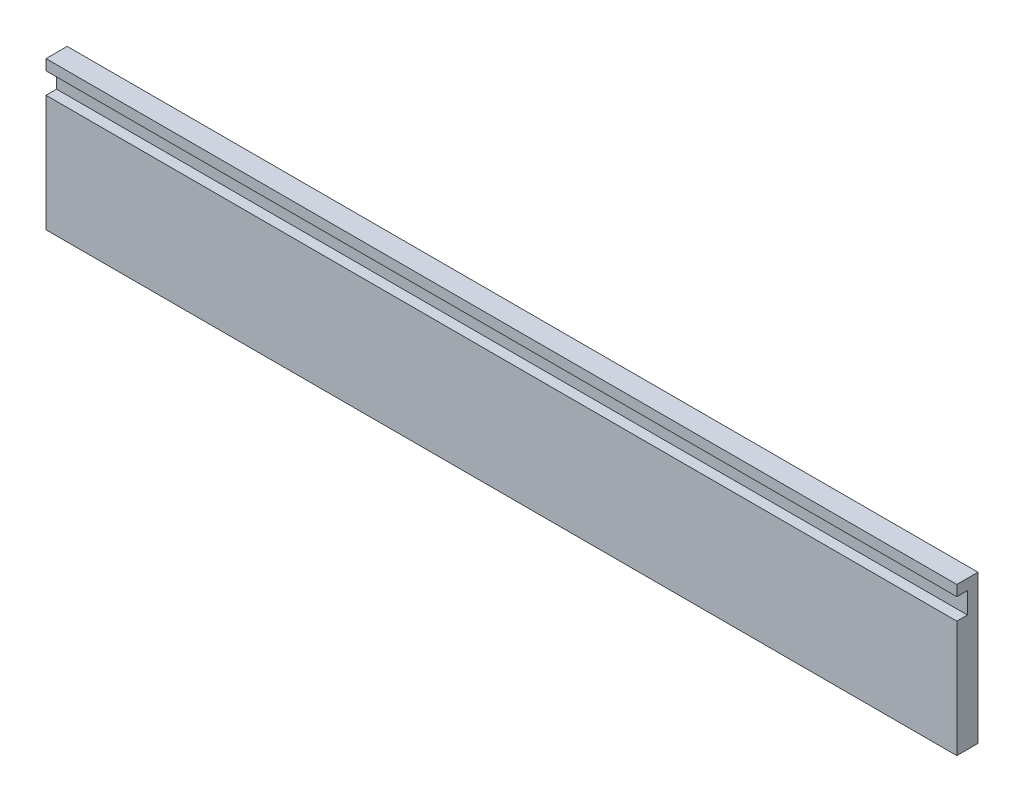
ISO-10303-21;
HEADER;
FILE_DESCRIPTION(('STEP AP214'),'2;1');
FILE_NAME('part.step','',(''),(''),'','','');
FILE_SCHEMA(('AUTOMOTIVE_DESIGN { 1 0 10303 214 1 1 1 1 }'));
ENDSEC;
DATA;
#1=APPLICATION_CONTEXT('core data for automotive mechanical design processes');
#2=APPLICATION_PROTOCOL_DEFINITION('international standard','automotive_design',2000,#1);
#3=PRODUCT_CONTEXT('',#1,'mechanical');
#4=PRODUCT('Part','Part','',(#3));
#5=PRODUCT_RELATED_PRODUCT_CATEGORY('part','',(#4));
#6=PRODUCT_DEFINITION_FORMATION('','',#4);
#7=PRODUCT_DEFINITION_CONTEXT('part definition',#1,'design');
#8=PRODUCT_DEFINITION('design','',#6,#7);
#9=PRODUCT_DEFINITION_SHAPE('','',#8);
#10=(LENGTH_UNIT() NAMED_UNIT(*) SI_UNIT(.MILLI.,.METRE.));
#11=(NAMED_UNIT(*) PLANE_ANGLE_UNIT() SI_UNIT($,.RADIAN.));
#12=(NAMED_UNIT(*) SI_UNIT($,.STERADIAN.) SOLID_ANGLE_UNIT());
#13=UNCERTAINTY_MEASURE_WITH_UNIT(LENGTH_MEASURE(1.E-05),#10,'distance_accuracy_value','');
#14=(GEOMETRIC_REPRESENTATION_CONTEXT(3) GLOBAL_UNCERTAINTY_ASSIGNED_CONTEXT((#13)) GLOBAL_UNIT_ASSIGNED_CONTEXT((#10,
#11,#12)) REPRESENTATION_CONTEXT('',''));
#15=CARTESIAN_POINT('',(0.,0.,0.));
#16=DIRECTION('',(0.,0.,1.));
#17=DIRECTION('',(1.,0.,0.));
#18=AXIS2_PLACEMENT_3D('',#15,#16,#17);
#19=CARTESIAN_POINT('',(0.,0.,12.7));
#20=DIRECTION('',(0.,0.,1.));
#21=DIRECTION('',(1.,0.,0.));
#22=AXIS2_PLACEMENT_3D('',#19,#20,#21);
#23=PLANE('',#22);
#24=DIRECTION('',(-1.,0.,0.));
#25=VECTOR('',#24,1.);
#26=CARTESIAN_POINT('',(-214.437575757576,87.9378787878788,12.7));
#27=LINE('',#26,#25);
#28=CARTESIAN_POINT('',(331.662424242424,87.9378787878788,12.7));
#29=VERTEX_POINT('',#28);
#30=CARTESIAN_POINT('',(-214.437575757576,87.9378787878788,12.7));
#31=VERTEX_POINT('',#30);
#32=EDGE_CURVE('E131',#29,#31,#27,.T.);
#33=ORIENTED_EDGE('',*,*,#32,.F.);
#34=DIRECTION('',(0.,1.,0.));
#35=VECTOR('',#34,1.);
#36=CARTESIAN_POINT('',(331.662424242424,94.2878787878788,12.7));
#37=LINE('',#36,#35);
#38=CARTESIAN_POINT('',(331.662424242424,94.2878787878788,12.7));
#39=VERTEX_POINT('',#38);
#40=EDGE_CURVE('E149',#29,#39,#37,.T.);
#41=ORIENTED_EDGE('',*,*,#40,.T.);
#42=DIRECTION('',(-1.,0.,0.));
#43=VECTOR('',#42,1.);
#44=CARTESIAN_POINT('',(-214.437575757576,94.2878787878788,12.7));
#45=LINE('',#44,#43);
#46=CARTESIAN_POINT('',(-214.437575757576,94.2878787878788,12.7));
#47=VERTEX_POINT('',#46);
#48=EDGE_CURVE('E63',#39,#47,#45,.T.);
#49=ORIENTED_EDGE('',*,*,#48,.T.);
#50=DIRECTION('',(0.,-1.,0.));
#51=VECTOR('',#50,1.);
#52=CARTESIAN_POINT('',(-214.437575757576,94.2878787878788,12.7));
#53=LINE('',#52,#51);
#54=EDGE_CURVE('E143',#47,#31,#53,.T.);
#55=ORIENTED_EDGE('',*,*,#54,.T.);
#56=EDGE_LOOP('',(#33,#41,#49,#55));
#57=FACE_BOUND('',#56,.T.);
#58=ADVANCED_FACE('F38',(#57),#23,.T.);
#59=CARTESIAN_POINT('',(-214.437575757576,94.2878787878788,12.7));
#60=DIRECTION('',(1.,0.,0.));
#61=DIRECTION('',(0.,0.,-1.));
#62=AXIS2_PLACEMENT_3D('',#59,#60,#61);
#63=PLANE('',#62);
#64=DIRECTION('',(0.,-1.,0.));
#65=VECTOR('',#64,1.);
#66=CARTESIAN_POINT('',(-214.437575757576,87.9378787878788,6.35));
#67=LINE('',#66,#65);
#68=CARTESIAN_POINT('',(-214.437575757576,87.9378787878788,6.35));
#69=VERTEX_POINT('',#68);
#70=CARTESIAN_POINT('',(-214.437575757576,75.2378787878788,6.35));
#71=VERTEX_POINT('',#70);
#72=EDGE_CURVE('E121',#69,#71,#67,.T.);
#73=ORIENTED_EDGE('',*,*,#72,.F.);
#74=DIRECTION('',(0.,0.,1.));
#75=VECTOR('',#74,1.);
#76=CARTESIAN_POINT('',(-214.437575757576,87.9378787878788,6.35));
#77=LINE('',#76,#75);
#78=EDGE_CURVE('E162',#69,#31,#77,.T.);
#79=ORIENTED_EDGE('',*,*,#78,.T.);
#80=ORIENTED_EDGE('',*,*,#54,.F.);
#81=DIRECTION('',(0.,0.,-1.));
#82=VECTOR('',#81,1.);
#83=CARTESIAN_POINT('',(-214.437575757576,94.2878787878788,12.7));
#84=LINE('',#83,#82);
#85=CARTESIAN_POINT('',(-214.437575757576,94.2878787878788,0.));
#86=VERTEX_POINT('',#85);
#87=EDGE_CURVE('E156',#47,#86,#84,.T.);
#88=ORIENTED_EDGE('',*,*,#87,.T.);
#89=DIRECTION('',(0.,-1.,0.));
#90=VECTOR('',#89,1.);
#91=CARTESIAN_POINT('',(-214.437575757576,94.2878787878788,0.));
#92=LINE('',#91,#90);
#93=CARTESIAN_POINT('',(-214.437575757576,5.38787878787881,0.));
#94=VERTEX_POINT('',#93);
#95=EDGE_CURVE('E157',#86,#94,#92,.T.);
#96=ORIENTED_EDGE('',*,*,#95,.T.);
#97=DIRECTION('',(0.,0.,-1.));
#98=VECTOR('',#97,1.);
#99=CARTESIAN_POINT('',(-214.437575757576,5.38787878787881,12.7));
#100=LINE('',#99,#98);
#101=CARTESIAN_POINT('',(-214.437575757576,5.38787878787881,12.7));
#102=VERTEX_POINT('',#101);
#103=EDGE_CURVE('E11',#102,#94,#100,.T.);
#104=ORIENTED_EDGE('',*,*,#103,.F.);
#105=CARTESIAN_POINT('',(-214.437575757576,75.2378787878788,12.7));
#106=VERTEX_POINT('',#105);
#107=EDGE_CURVE('E91',#106,#102,#53,.T.);
#108=ORIENTED_EDGE('',*,*,#107,.F.);
#109=DIRECTION('',(0.,0.,1.));
#110=VECTOR('',#109,1.);
#111=CARTESIAN_POINT('',(-214.437575757576,75.2378787878788,6.35));
#112=LINE('',#111,#110);
#113=EDGE_CURVE('E54',#71,#106,#112,.T.);
#114=ORIENTED_EDGE('',*,*,#113,.F.);
#115=EDGE_LOOP('',(#73,#79,#80,#88,#96,#104,#108,#114));
#116=FACE_BOUND('',#115,.T.);
#117=ADVANCED_FACE('F40',(#116),#63,.F.);
#118=CARTESIAN_POINT('',(-214.437575757576,5.38787878787881,12.7));
#119=DIRECTION('',(0.,1.,0.));
#120=DIRECTION('',(0.,0.,1.));
#121=AXIS2_PLACEMENT_3D('',#118,#119,#120);
#122=PLANE('',#121);
#123=DIRECTION('',(1.,0.,0.));
#124=VECTOR('',#123,1.);
#125=CARTESIAN_POINT('',(-214.437575757576,5.38787878787881,0.));
#126=LINE('',#125,#124);
#127=CARTESIAN_POINT('',(331.662424242424,5.38787878787881,0.));
#128=VERTEX_POINT('',#127);
#129=EDGE_CURVE('E161',#94,#128,#126,.T.);
#130=ORIENTED_EDGE('',*,*,#129,.T.);
#131=DIRECTION('',(0.,0.,-1.));
#132=VECTOR('',#131,1.);
#133=CARTESIAN_POINT('',(331.662424242424,5.38787878787881,12.7));
#134=LINE('',#133,#132);
#135=CARTESIAN_POINT('',(331.662424242424,5.38787878787881,12.7));
#136=VERTEX_POINT('',#135);
#137=EDGE_CURVE('E47',#136,#128,#134,.T.);
#138=ORIENTED_EDGE('',*,*,#137,.F.);
#139=DIRECTION('',(1.,0.,0.));
#140=VECTOR('',#139,1.);
#141=CARTESIAN_POINT('',(-214.437575757576,5.38787878787881,12.7));
#142=LINE('',#141,#140);
#143=EDGE_CURVE('E146',#102,#136,#142,.T.);
#144=ORIENTED_EDGE('',*,*,#143,.F.);
#145=ORIENTED_EDGE('',*,*,#103,.T.);
#146=EDGE_LOOP('',(#130,#138,#144,#145));
#147=FACE_BOUND('',#146,.T.);
#148=ADVANCED_FACE('F212',(#147),#122,.F.);
#149=CARTESIAN_POINT('',(331.662424242424,94.2878787878788,12.7));
#150=DIRECTION('',(-1.,0.,0.));
#151=DIRECTION('',(0.,0.,1.));
#152=AXIS2_PLACEMENT_3D('',#149,#150,#151);
#153=PLANE('',#152);
#154=ORIENTED_EDGE('',*,*,#40,.F.);
#155=DIRECTION('',(0.,0.,1.));
#156=VECTOR('',#155,1.);
#157=CARTESIAN_POINT('',(331.662424242424,87.9378787878788,6.35));
#158=LINE('',#157,#156);
#159=CARTESIAN_POINT('',(331.662424242424,87.9378787878788,6.35));
#160=VERTEX_POINT('',#159);
#161=EDGE_CURVE('E138',#160,#29,#158,.T.);
#162=ORIENTED_EDGE('',*,*,#161,.F.);
#163=DIRECTION('',(0.,1.,0.));
#164=VECTOR('',#163,1.);
#165=CARTESIAN_POINT('',(331.662424242424,87.9378787878788,6.35));
#166=LINE('',#165,#164);
#167=CARTESIAN_POINT('',(331.662424242424,75.2378787878788,6.35));
#168=VERTEX_POINT('',#167);
#169=EDGE_CURVE('E120',#168,#160,#166,.T.);
#170=ORIENTED_EDGE('',*,*,#169,.F.);
#171=DIRECTION('',(0.,0.,1.));
#172=VECTOR('',#171,1.);
#173=CARTESIAN_POINT('',(331.662424242424,75.2378787878788,6.35));
#174=LINE('',#173,#172);
#175=CARTESIAN_POINT('',(331.662424242424,75.2378787878788,12.7));
#176=VERTEX_POINT('',#175);
#177=EDGE_CURVE('E116',#168,#176,#174,.T.);
#178=ORIENTED_EDGE('',*,*,#177,.T.);
#179=EDGE_CURVE('E150',#136,#176,#37,.T.);
#180=ORIENTED_EDGE('',*,*,#179,.F.);
#181=ORIENTED_EDGE('',*,*,#137,.T.);
#182=DIRECTION('',(0.,1.,0.));
#183=VECTOR('',#182,1.);
#184=CARTESIAN_POINT('',(331.662424242424,94.2878787878788,0.));
#185=LINE('',#184,#183);
#186=CARTESIAN_POINT('',(331.662424242424,94.2878787878788,0.));
#187=VERTEX_POINT('',#186);
#188=EDGE_CURVE('E165',#128,#187,#185,.T.);
#189=ORIENTED_EDGE('',*,*,#188,.T.);
#190=DIRECTION('',(0.,0.,-1.));
#191=VECTOR('',#190,1.);
#192=CARTESIAN_POINT('',(331.662424242424,94.2878787878788,12.7));
#193=LINE('',#192,#191);
#194=EDGE_CURVE('E172',#39,#187,#193,.T.);
#195=ORIENTED_EDGE('',*,*,#194,.F.);
#196=EDGE_LOOP('',(#154,#162,#170,#178,#180,#181,#189,#195));
#197=FACE_BOUND('',#196,.T.);
#198=ADVANCED_FACE('F181',(#197),#153,.F.);
#199=CARTESIAN_POINT('',(-214.437575757576,94.2878787878788,12.7));
#200=DIRECTION('',(0.,-1.,0.));
#201=DIRECTION('',(0.,0.,-1.));
#202=AXIS2_PLACEMENT_3D('',#199,#200,#201);
#203=PLANE('',#202);
#204=DIRECTION('',(-1.,0.,0.));
#205=VECTOR('',#204,1.);
#206=CARTESIAN_POINT('',(-214.437575757576,94.2878787878788,0.));
#207=LINE('',#206,#205);
#208=EDGE_CURVE('E84',#187,#86,#207,.T.);
#209=ORIENTED_EDGE('',*,*,#208,.T.);
#210=ORIENTED_EDGE('',*,*,#87,.F.);
#211=ORIENTED_EDGE('',*,*,#48,.F.);
#212=ORIENTED_EDGE('',*,*,#194,.T.);
#213=EDGE_LOOP('',(#209,#210,#211,#212));
#214=FACE_BOUND('',#213,.T.);
#215=ADVANCED_FACE('F188',(#214),#203,.F.);
#216=DIRECTION('',(1.,0.,0.));
#217=VECTOR('',#216,1.);
#218=CARTESIAN_POINT('',(-214.437575757576,75.2378787878788,12.7));
#219=LINE('',#218,#217);
#220=EDGE_CURVE('E200',#106,#176,#219,.T.);
#221=ORIENTED_EDGE('',*,*,#220,.F.);
#222=ORIENTED_EDGE('',*,*,#107,.T.);
#223=ORIENTED_EDGE('',*,*,#143,.T.);
#224=ORIENTED_EDGE('',*,*,#179,.T.);
#225=EDGE_LOOP('',(#221,#222,#223,#224));
#226=FACE_BOUND('',#225,.T.);
#227=ADVANCED_FACE('F207',(#226),#23,.T.);
#228=CARTESIAN_POINT('',(0.,0.,0.));
#229=DIRECTION('',(0.,0.,1.));
#230=DIRECTION('',(1.,0.,0.));
#231=AXIS2_PLACEMENT_3D('',#228,#229,#230);
#232=PLANE('',#231);
#233=ORIENTED_EDGE('',*,*,#95,.F.);
#234=ORIENTED_EDGE('',*,*,#208,.F.);
#235=ORIENTED_EDGE('',*,*,#188,.F.);
#236=ORIENTED_EDGE('',*,*,#129,.F.);
#237=EDGE_LOOP('',(#233,#234,#235,#236));
#238=FACE_BOUND('',#237,.T.);
#239=ADVANCED_FACE('F186',(#238),#232,.F.);
#240=CARTESIAN_POINT('',(-214.437575757576,87.9378787878788,6.35));
#241=DIRECTION('',(0.,1.,0.));
#242=DIRECTION('',(0.,0.,1.));
#243=AXIS2_PLACEMENT_3D('',#240,#241,#242);
#244=PLANE('',#243);
#245=ORIENTED_EDGE('',*,*,#32,.T.);
#246=ORIENTED_EDGE('',*,*,#78,.F.);
#247=DIRECTION('',(-1.,0.,0.));
#248=VECTOR('',#247,1.);
#249=CARTESIAN_POINT('',(-214.437575757576,87.9378787878788,6.35));
#250=LINE('',#249,#248);
#251=EDGE_CURVE('E127',#160,#69,#250,.T.);
#252=ORIENTED_EDGE('',*,*,#251,.F.);
#253=ORIENTED_EDGE('',*,*,#161,.T.);
#254=EDGE_LOOP('',(#245,#246,#252,#253));
#255=FACE_BOUND('',#254,.T.);
#256=ADVANCED_FACE('F204',(#255),#244,.F.);
#257=CARTESIAN_POINT('',(-214.437575757576,75.2378787878788,6.35));
#258=DIRECTION('',(0.,-1.,0.));
#259=DIRECTION('',(0.,0.,-1.));
#260=AXIS2_PLACEMENT_3D('',#257,#258,#259);
#261=PLANE('',#260);
#262=ORIENTED_EDGE('',*,*,#220,.T.);
#263=ORIENTED_EDGE('',*,*,#177,.F.);
#264=DIRECTION('',(1.,0.,0.));
#265=VECTOR('',#264,1.);
#266=CARTESIAN_POINT('',(-214.437575757576,75.2378787878788,6.35));
#267=LINE('',#266,#265);
#268=EDGE_CURVE('E112',#71,#168,#267,.T.);
#269=ORIENTED_EDGE('',*,*,#268,.F.);
#270=ORIENTED_EDGE('',*,*,#113,.T.);
#271=EDGE_LOOP('',(#262,#263,#269,#270));
#272=FACE_BOUND('',#271,.T.);
#273=ADVANCED_FACE('F114',(#272),#261,.F.);
#274=CARTESIAN_POINT('',(0.,0.,6.35));
#275=DIRECTION('',(0.,0.,1.));
#276=DIRECTION('',(1.,0.,0.));
#277=AXIS2_PLACEMENT_3D('',#274,#275,#276);
#278=PLANE('',#277);
#279=ORIENTED_EDGE('',*,*,#72,.T.);
#280=ORIENTED_EDGE('',*,*,#268,.T.);
#281=ORIENTED_EDGE('',*,*,#169,.T.);
#282=ORIENTED_EDGE('',*,*,#251,.T.);
#283=EDGE_LOOP('',(#279,#280,#281,#282));
#284=FACE_BOUND('',#283,.T.);
#285=ADVANCED_FACE('F125',(#284),#278,.T.);
#286=CLOSED_SHELL('',(#58,#117,#148,#198,#215,#227,#239,#256,#273,#285));
#287=MANIFOLD_SOLID_BREP('B2',#286);
#288=ADVANCED_BREP_SHAPE_REPRESENTATION('',(#18,#287),#14);
#289=SHAPE_DEFINITION_REPRESENTATION(#9,#288);
ENDSEC;
END-ISO-10303-21;
